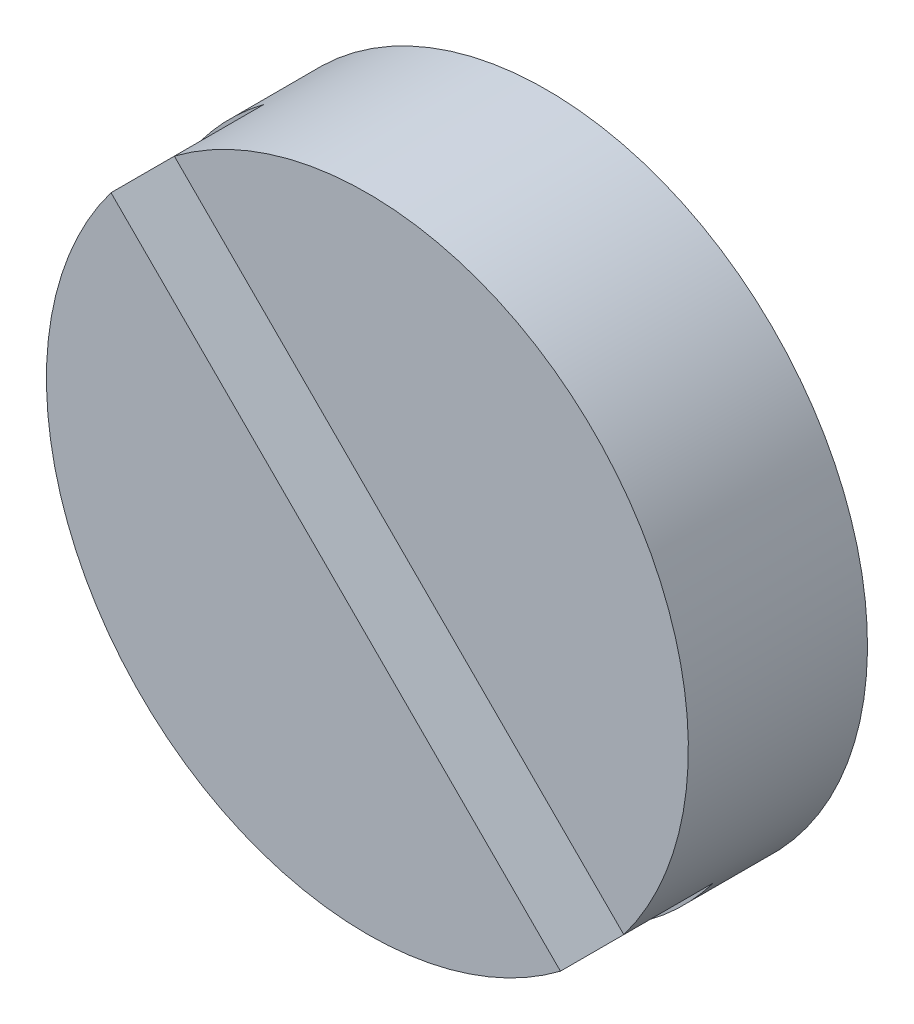
ISO-10303-21;
HEADER;
FILE_DESCRIPTION(('STEP AP214'),'2;1');
FILE_NAME('part.step','',(''),(''),'','','');
FILE_SCHEMA(('AUTOMOTIVE_DESIGN { 1 0 10303 214 1 1 1 1 }'));
ENDSEC;
DATA;
#1=APPLICATION_CONTEXT('core data for automotive mechanical design processes');
#2=APPLICATION_PROTOCOL_DEFINITION('international standard','automotive_design',2000,#1);
#3=PRODUCT_CONTEXT('',#1,'mechanical');
#4=PRODUCT('Part','Part','',(#3));
#5=PRODUCT_RELATED_PRODUCT_CATEGORY('part','',(#4));
#6=PRODUCT_DEFINITION_FORMATION('','',#4);
#7=PRODUCT_DEFINITION_CONTEXT('part definition',#1,'design');
#8=PRODUCT_DEFINITION('design','',#6,#7);
#9=PRODUCT_DEFINITION_SHAPE('','',#8);
#10=(LENGTH_UNIT() NAMED_UNIT(*) SI_UNIT(.MILLI.,.METRE.));
#11=(NAMED_UNIT(*) PLANE_ANGLE_UNIT() SI_UNIT($,.RADIAN.));
#12=(NAMED_UNIT(*) SI_UNIT($,.STERADIAN.) SOLID_ANGLE_UNIT());
#13=UNCERTAINTY_MEASURE_WITH_UNIT(LENGTH_MEASURE(1.E-05),#10,'distance_accuracy_value','');
#14=(GEOMETRIC_REPRESENTATION_CONTEXT(3) GLOBAL_UNCERTAINTY_ASSIGNED_CONTEXT((#13)) GLOBAL_UNIT_ASSIGNED_CONTEXT((#10,
#11,#12)) REPRESENTATION_CONTEXT('',''));
#15=CARTESIAN_POINT('',(0.,0.,0.));
#16=DIRECTION('',(0.,0.,1.));
#17=DIRECTION('',(1.,0.,0.));
#18=AXIS2_PLACEMENT_3D('',#15,#16,#17);
#19=CARTESIAN_POINT('',(17.3029324650882,44.6422521676476,49.3014));
#20=DIRECTION('',(0.707106781186557,0.707106781186538,0.));
#21=DIRECTION('',(0.,0.,-1.));
#22=AXIS2_PLACEMENT_3D('',#19,#20,#21);
#23=PLANE('',#22);
#24=DIRECTION('',(0.,0.,1.));
#25=VECTOR('',#24,1.);
#26=CARTESIAN_POINT('',(13.0968255257678,48.8483591069681,48.8442));
#27=LINE('',#26,#25);
#28=CARTESIAN_POINT('',(13.0968255257677,48.8483591069681,48.4632));
#29=VERTEX_POINT('',#28);
#30=CARTESIAN_POINT('',(13.0968255257678,48.8483591069681,49.2252));
#31=VERTEX_POINT('',#30);
#32=EDGE_CURVE('E79',#29,#31,#27,.T.);
#33=ORIENTED_EDGE('',*,*,#32,.T.);
#34=DIRECTION('',(-0.707106781186549,0.707106781186546,0.));
#35=VECTOR('',#34,1.);
#36=CARTESIAN_POINT('',(15.0086923163679,46.9364923163679,49.2252));
#37=LINE('',#36,#35);
#38=CARTESIAN_POINT('',(16.9205591069681,45.0246255257677,49.2252));
#39=VERTEX_POINT('',#38);
#40=EDGE_CURVE('E81',#39,#31,#37,.T.);
#41=ORIENTED_EDGE('',*,*,#40,.F.);
#42=DIRECTION('',(0.,0.,-1.));
#43=VECTOR('',#42,1.);
#44=CARTESIAN_POINT('',(16.9205591069681,45.0246255257677,48.8442));
#45=LINE('',#44,#43);
#46=CARTESIAN_POINT('',(16.920559106968,45.0246255257677,48.4632));
#47=VERTEX_POINT('',#46);
#48=EDGE_CURVE('E82',#39,#47,#45,.T.);
#49=ORIENTED_EDGE('',*,*,#48,.T.);
#50=DIRECTION('',(0.707106781186547,-0.707106781186548,0.));
#51=VECTOR('',#50,1.);
#52=CARTESIAN_POINT('',(15.0086923163678,46.9364923163679,48.4632));
#53=LINE('',#52,#51);
#54=EDGE_CURVE('E66',#29,#47,#53,.T.);
#55=ORIENTED_EDGE('',*,*,#54,.F.);
#56=EDGE_LOOP('',(#33,#41,#49,#55));
#57=FACE_BOUND('',#56,.T.);
#58=ADVANCED_FACE('F17',(#57),#23,.T.);
#59=CARTESIAN_POINT('',(9.48893551574705,46.6625874624914,49.2252));
#60=DIRECTION('',(0.,0.,1.));
#61=DIRECTION('',(0.70710678118655,-0.707106781186545,0.));
#62=AXIS2_PLACEMENT_3D('',#59,#60,#61);
#63=PLANE('',#62);
#64=ORIENTED_EDGE('',*,*,#40,.T.);
#65=CARTESIAN_POINT('',(15.2781,47.2059,49.2252));
#66=DIRECTION('',(0.,0.,1.));
#67=DIRECTION('',(0.,-1.,0.));
#68=AXIS2_PLACEMENT_3D('',#65,#66,#67);
#69=CIRCLE('',#68,2.73049999999991);
#70=EDGE_CURVE('E67',#39,#31,#69,.F.);
#71=ORIENTED_EDGE('',*,*,#70,.F.);
#72=EDGE_LOOP('',(#64,#71));
#73=FACE_BOUND('',#72,.T.);
#74=ADVANCED_FACE('F91',(#73),#63,.T.);
#75=CARTESIAN_POINT('',(20.5131587381575,47.2059,48.4632));
#76=DIRECTION('',(0.,0.,1.));
#77=DIRECTION('',(-0.707106781186547,0.707106781186547,0.));
#78=AXIS2_PLACEMENT_3D('',#75,#76,#77);
#79=PLANE('',#78);
#80=ORIENTED_EDGE('',*,*,#54,.T.);
#81=CARTESIAN_POINT('',(15.2781,47.2059,48.4632));
#82=DIRECTION('',(0.,0.,1.));
#83=DIRECTION('',(0.,-1.,0.));
#84=AXIS2_PLACEMENT_3D('',#81,#82,#83);
#85=CIRCLE('',#84,2.73049999999991);
#86=CARTESIAN_POINT('',(17.4593744742323,45.5634408930319,48.4632));
#87=VERTEX_POINT('',#86);
#88=EDGE_CURVE('E21',#87,#47,#85,.F.);
#89=ORIENTED_EDGE('',*,*,#88,.F.);
#90=DIRECTION('',(0.707106781186539,-0.707106781186556,0.));
#91=VECTOR('',#90,1.);
#92=CARTESIAN_POINT('',(15.5475076836321,47.4753076836321,48.4632));
#93=LINE('',#92,#91);
#94=CARTESIAN_POINT('',(13.6356408930319,49.3871744742323,48.4632));
#95=VERTEX_POINT('',#94);
#96=EDGE_CURVE('E63',#95,#87,#93,.T.);
#97=ORIENTED_EDGE('',*,*,#96,.F.);
#98=CARTESIAN_POINT('',(15.2781,47.2059,48.4632));
#99=DIRECTION('',(0.,0.,1.));
#100=DIRECTION('',(0.,-1.,0.));
#101=AXIS2_PLACEMENT_3D('',#98,#99,#100);
#102=CIRCLE('',#101,2.73049999999991);
#103=EDGE_CURVE('E56',#29,#95,#102,.F.);
#104=ORIENTED_EDGE('',*,*,#103,.F.);
#105=EDGE_LOOP('',(#80,#89,#97,#104));
#106=FACE_BOUND('',#105,.T.);
#107=ADVANCED_FACE('F62',(#106),#79,.T.);
#108=CARTESIAN_POINT('',(17.8417478323523,45.1810675349118,48.387));
#109=DIRECTION('',(-0.707106781186556,-0.707106781186539,0.));
#110=DIRECTION('',(0.,0.,1.));
#111=AXIS2_PLACEMENT_3D('',#108,#109,#110);
#112=PLANE('',#111);
#113=DIRECTION('',(0.,0.,-1.));
#114=VECTOR('',#113,1.);
#115=CARTESIAN_POINT('',(13.6356408930319,49.3871744742323,48.8442));
#116=LINE('',#115,#114);
#117=CARTESIAN_POINT('',(13.6356408930319,49.3871744742323,49.2252));
#118=VERTEX_POINT('',#117);
#119=EDGE_CURVE('E71',#118,#95,#116,.T.);
#120=ORIENTED_EDGE('',*,*,#119,.T.);
#121=ORIENTED_EDGE('',*,*,#96,.T.);
#122=DIRECTION('',(0.,0.,1.));
#123=VECTOR('',#122,1.);
#124=CARTESIAN_POINT('',(17.4593744742323,45.5634408930318,48.8442));
#125=LINE('',#124,#123);
#126=CARTESIAN_POINT('',(17.4593744742323,45.5634408930319,49.2252));
#127=VERTEX_POINT('',#126);
#128=EDGE_CURVE('E36',#87,#127,#125,.T.);
#129=ORIENTED_EDGE('',*,*,#128,.T.);
#130=DIRECTION('',(0.70710678118655,-0.707106781186545,0.));
#131=VECTOR('',#130,1.);
#132=CARTESIAN_POINT('',(15.5475076836321,47.4753076836321,49.2252));
#133=LINE('',#132,#131);
#134=EDGE_CURVE('E74',#118,#127,#133,.T.);
#135=ORIENTED_EDGE('',*,*,#134,.F.);
#136=EDGE_LOOP('',(#120,#121,#129,#135));
#137=FACE_BOUND('',#136,.T.);
#138=ADVANCED_FACE('F73',(#137),#112,.T.);
#139=CARTESIAN_POINT('',(15.2781,40.6939051461275,47.7012));
#140=DIRECTION('',(0.,0.,-1.));
#141=DIRECTION('',(-0.707106781186542,0.707106781186553,0.));
#142=AXIS2_PLACEMENT_3D('',#139,#140,#141);
#143=PLANE('',#142);
#144=CARTESIAN_POINT('',(15.2781,47.2059,47.7012));
#145=DIRECTION('',(0.,0.,1.));
#146=DIRECTION('',(0.,-1.,0.));
#147=AXIS2_PLACEMENT_3D('',#144,#145,#146);
#148=CIRCLE('',#147,2.73049999999991);
#149=CARTESIAN_POINT('',(15.2781,44.4754000000001,47.7012));
#150=VERTEX_POINT('',#149);
#151=EDGE_CURVE('E27',#150,#150,#148,.T.);
#152=ORIENTED_EDGE('',*,*,#151,.F.);
#153=EDGE_LOOP('',(#152));
#154=FACE_BOUND('',#153,.T.);
#155=ADVANCED_FACE('F107',(#154),#143,.T.);
#156=CARTESIAN_POINT('',(10.5755605907643,47.7492125375086,49.2252));
#157=DIRECTION('',(0.,0.,1.));
#158=DIRECTION('',(0.70710678118655,-0.707106781186545,0.));
#159=AXIS2_PLACEMENT_3D('',#156,#157,#158);
#160=PLANE('',#159);
#161=ORIENTED_EDGE('',*,*,#134,.T.);
#162=CARTESIAN_POINT('',(15.2781,47.2059,49.2252));
#163=DIRECTION('',(0.,0.,1.));
#164=DIRECTION('',(0.,-1.,0.));
#165=AXIS2_PLACEMENT_3D('',#162,#163,#164);
#166=CIRCLE('',#165,2.73049999999991);
#167=EDGE_CURVE('E11',#118,#127,#166,.F.);
#168=ORIENTED_EDGE('',*,*,#167,.F.);
#169=EDGE_LOOP('',(#161,#168));
#170=FACE_BOUND('',#169,.T.);
#171=ADVANCED_FACE('F19',(#170),#160,.T.);
#172=CARTESIAN_POINT('',(15.2781,47.2059,49.2252));
#173=DIRECTION('',(0.,0.,1.));
#174=DIRECTION('',(0.,-1.,0.));
#175=AXIS2_PLACEMENT_3D('',#172,#173,#174);
#176=CYLINDRICAL_SURFACE('',#175,2.73049999999991);
#177=ORIENTED_EDGE('',*,*,#128,.F.);
#178=ORIENTED_EDGE('',*,*,#88,.T.);
#179=ORIENTED_EDGE('',*,*,#48,.F.);
#180=ORIENTED_EDGE('',*,*,#70,.T.);
#181=ORIENTED_EDGE('',*,*,#32,.F.);
#182=ORIENTED_EDGE('',*,*,#103,.T.);
#183=ORIENTED_EDGE('',*,*,#119,.F.);
#184=ORIENTED_EDGE('',*,*,#167,.T.);
#185=EDGE_LOOP('',(#177,#178,#179,#180,#181,#182,#183,#184));
#186=FACE_BOUND('',#185,.T.);
#187=ORIENTED_EDGE('',*,*,#151,.T.);
#188=EDGE_LOOP('',(#187));
#189=FACE_BOUND('',#188,.T.);
#190=ADVANCED_FACE('F68',(#186,#189),#176,.T.);
#191=CLOSED_SHELL('',(#58,#74,#107,#138,#155,#171,#190));
#192=MANIFOLD_SOLID_BREP('B1',#191);
#193=ADVANCED_BREP_SHAPE_REPRESENTATION('',(#18,#192),#14);
#194=SHAPE_DEFINITION_REPRESENTATION(#9,#193);
ENDSEC;
END-ISO-10303-21;
